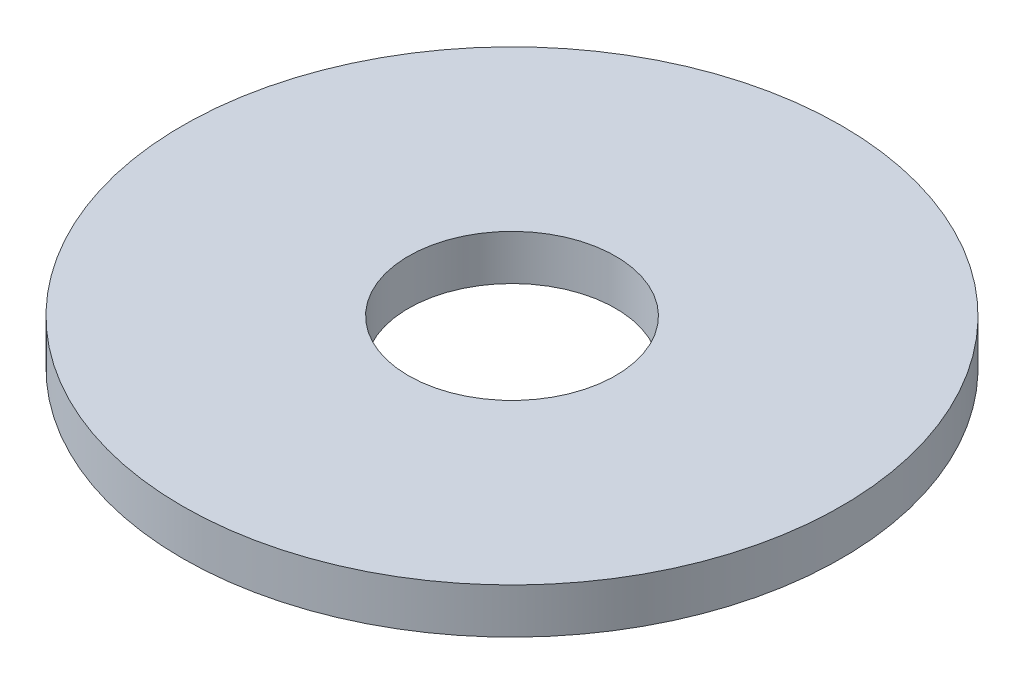
ISO-10303-21;
HEADER;
FILE_DESCRIPTION(('STEP AP214'),'2;1');
FILE_NAME('part.step','',(''),(''),'','','');
FILE_SCHEMA(('AUTOMOTIVE_DESIGN { 1 0 10303 214 1 1 1 1 }'));
ENDSEC;
DATA;
#1=APPLICATION_CONTEXT('core data for automotive mechanical design processes');
#2=APPLICATION_PROTOCOL_DEFINITION('international standard','automotive_design',2000,#1);
#3=PRODUCT_CONTEXT('',#1,'mechanical');
#4=PRODUCT('Part','Part','',(#3));
#5=PRODUCT_RELATED_PRODUCT_CATEGORY('part','',(#4));
#6=PRODUCT_DEFINITION_FORMATION('','',#4);
#7=PRODUCT_DEFINITION_CONTEXT('part definition',#1,'design');
#8=PRODUCT_DEFINITION('design','',#6,#7);
#9=PRODUCT_DEFINITION_SHAPE('','',#8);
#10=(LENGTH_UNIT() NAMED_UNIT(*) SI_UNIT(.MILLI.,.METRE.));
#11=(NAMED_UNIT(*) PLANE_ANGLE_UNIT() SI_UNIT($,.RADIAN.));
#12=(NAMED_UNIT(*) SI_UNIT($,.STERADIAN.) SOLID_ANGLE_UNIT());
#13=UNCERTAINTY_MEASURE_WITH_UNIT(LENGTH_MEASURE(1.E-05),#10,'distance_accuracy_value','');
#14=(GEOMETRIC_REPRESENTATION_CONTEXT(3) GLOBAL_UNCERTAINTY_ASSIGNED_CONTEXT((#13)) GLOBAL_UNIT_ASSIGNED_CONTEXT((#10,
#11,#12)) REPRESENTATION_CONTEXT('',''));
#15=CARTESIAN_POINT('',(0.,0.,0.));
#16=DIRECTION('',(0.,0.,1.));
#17=DIRECTION('',(1.,0.,0.));
#18=AXIS2_PLACEMENT_3D('',#15,#16,#17);
#19=CARTESIAN_POINT('',(0.,12.,0.));
#20=DIRECTION('',(0.,-1.,0.));
#21=DIRECTION('',(0.,0.,-1.));
#22=AXIS2_PLACEMENT_3D('',#19,#20,#21);
#23=CYLINDRICAL_SURFACE('',#22,87.5);
#24=CARTESIAN_POINT('',(0.,12.,0.));
#25=DIRECTION('',(0.,1.,0.));
#26=DIRECTION('',(0.,0.,1.));
#27=AXIS2_PLACEMENT_3D('',#24,#25,#26);
#28=CIRCLE('',#27,87.5);
#29=CARTESIAN_POINT('',(0.,12.,87.5));
#30=VERTEX_POINT('',#29);
#31=EDGE_CURVE('E10',#30,#30,#28,.T.);
#32=ORIENTED_EDGE('',*,*,#31,.F.);
#33=EDGE_LOOP('',(#32));
#34=FACE_BOUND('',#33,.T.);
#35=CARTESIAN_POINT('',(0.,0.,0.));
#36=DIRECTION('',(0.,1.,0.));
#37=DIRECTION('',(0.,0.,1.));
#38=AXIS2_PLACEMENT_3D('',#35,#36,#37);
#39=CIRCLE('',#38,87.5);
#40=CARTESIAN_POINT('',(0.,0.,87.5));
#41=VERTEX_POINT('',#40);
#42=EDGE_CURVE('E37',#41,#41,#39,.T.);
#43=ORIENTED_EDGE('',*,*,#42,.T.);
#44=EDGE_LOOP('',(#43));
#45=FACE_BOUND('',#44,.T.);
#46=ADVANCED_FACE('F40',(#34,#45),#23,.T.);
#47=CARTESIAN_POINT('',(0.,12.,0.));
#48=DIRECTION('',(0.,1.,0.));
#49=DIRECTION('',(0.,0.,1.));
#50=AXIS2_PLACEMENT_3D('',#47,#48,#49);
#51=PLANE('',#50);
#52=CARTESIAN_POINT('',(0.,12.,0.));
#53=DIRECTION('',(0.,1.,0.));
#54=DIRECTION('',(0.,0.,1.));
#55=AXIS2_PLACEMENT_3D('',#52,#53,#54);
#56=CIRCLE('',#55,27.5);
#57=CARTESIAN_POINT('',(0.,12.,27.5));
#58=VERTEX_POINT('',#57);
#59=EDGE_CURVE('E50',#58,#58,#56,.T.);
#60=ORIENTED_EDGE('',*,*,#59,.F.);
#61=EDGE_LOOP('',(#60));
#62=FACE_BOUND('',#61,.T.);
#63=ORIENTED_EDGE('',*,*,#31,.T.);
#64=EDGE_LOOP('',(#63));
#65=FACE_BOUND('',#64,.T.);
#66=ADVANCED_FACE('F59',(#62,#65),#51,.T.);
#67=CARTESIAN_POINT('',(0.,0.,0.));
#68=DIRECTION('',(0.,1.,0.));
#69=DIRECTION('',(0.,0.,1.));
#70=AXIS2_PLACEMENT_3D('',#67,#68,#69);
#71=PLANE('',#70);
#72=CARTESIAN_POINT('',(0.,0.,0.));
#73=DIRECTION('',(0.,1.,0.));
#74=DIRECTION('',(0.,0.,1.));
#75=AXIS2_PLACEMENT_3D('',#72,#73,#74);
#76=CIRCLE('',#75,27.5);
#77=CARTESIAN_POINT('',(0.,0.,27.5));
#78=VERTEX_POINT('',#77);
#79=EDGE_CURVE('E47',#78,#78,#76,.T.);
#80=ORIENTED_EDGE('',*,*,#79,.T.);
#81=EDGE_LOOP('',(#80));
#82=FACE_BOUND('',#81,.T.);
#83=ORIENTED_EDGE('',*,*,#42,.F.);
#84=EDGE_LOOP('',(#83));
#85=FACE_BOUND('',#84,.T.);
#86=ADVANCED_FACE('F58',(#82,#85),#71,.F.);
#87=CARTESIAN_POINT('',(0.,12.,0.));
#88=DIRECTION('',(0.,-1.,0.));
#89=DIRECTION('',(0.,0.,-1.));
#90=AXIS2_PLACEMENT_3D('',#87,#88,#89);
#91=CYLINDRICAL_SURFACE('',#90,27.5);
#92=ORIENTED_EDGE('',*,*,#59,.T.);
#93=EDGE_LOOP('',(#92));
#94=FACE_BOUND('',#93,.T.);
#95=ORIENTED_EDGE('',*,*,#79,.F.);
#96=EDGE_LOOP('',(#95));
#97=FACE_BOUND('',#96,.T.);
#98=ADVANCED_FACE('F54',(#94,#97),#91,.F.);
#99=CLOSED_SHELL('',(#46,#66,#86,#98));
#100=MANIFOLD_SOLID_BREP('B2',#99);
#101=ADVANCED_BREP_SHAPE_REPRESENTATION('',(#18,#100),#14);
#102=SHAPE_DEFINITION_REPRESENTATION(#9,#101);
ENDSEC;
END-ISO-10303-21;
